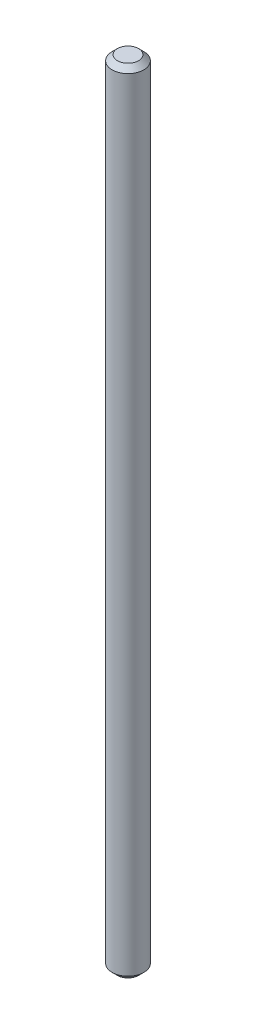
ISO-10303-21;
HEADER;
FILE_DESCRIPTION(('STEP AP214'),'2;1');
FILE_NAME('part.step','',(''),(''),'','','');
FILE_SCHEMA(('AUTOMOTIVE_DESIGN { 1 0 10303 214 1 1 1 1 }'));
ENDSEC;
DATA;
#1=APPLICATION_CONTEXT('core data for automotive mechanical design processes');
#2=APPLICATION_PROTOCOL_DEFINITION('international standard','automotive_design',2000,#1);
#3=PRODUCT_CONTEXT('',#1,'mechanical');
#4=PRODUCT('Part','Part','',(#3));
#5=PRODUCT_RELATED_PRODUCT_CATEGORY('part','',(#4));
#6=PRODUCT_DEFINITION_FORMATION('','',#4);
#7=PRODUCT_DEFINITION_CONTEXT('part definition',#1,'design');
#8=PRODUCT_DEFINITION('design','',#6,#7);
#9=PRODUCT_DEFINITION_SHAPE('','',#8);
#10=(LENGTH_UNIT() NAMED_UNIT(*) SI_UNIT(.MILLI.,.METRE.));
#11=(NAMED_UNIT(*) PLANE_ANGLE_UNIT() SI_UNIT($,.RADIAN.));
#12=(NAMED_UNIT(*) SI_UNIT($,.STERADIAN.) SOLID_ANGLE_UNIT());
#13=UNCERTAINTY_MEASURE_WITH_UNIT(LENGTH_MEASURE(1.E-05),#10,'distance_accuracy_value','');
#14=(GEOMETRIC_REPRESENTATION_CONTEXT(3) GLOBAL_UNCERTAINTY_ASSIGNED_CONTEXT((#13)) GLOBAL_UNIT_ASSIGNED_CONTEXT((#10,
#11,#12)) REPRESENTATION_CONTEXT('',''));
#15=CARTESIAN_POINT('',(0.,0.,0.));
#16=DIRECTION('',(0.,0.,1.));
#17=DIRECTION('',(1.,0.,0.));
#18=AXIS2_PLACEMENT_3D('',#15,#16,#17);
#19=CARTESIAN_POINT('',(0.,225.,0.));
#20=DIRECTION('',(0.,-1.,0.));
#21=DIRECTION('',(0.,0.,-1.));
#22=AXIS2_PLACEMENT_3D('',#19,#20,#21);
#23=CYLINDRICAL_SURFACE('',#22,9.);
#24=CARTESIAN_POINT('',(0.,222.,0.));
#25=DIRECTION('',(0.,1.,0.));
#26=DIRECTION('',(0.,0.,1.));
#27=AXIS2_PLACEMENT_3D('',#24,#25,#26);
#28=CIRCLE('',#27,9.);
#29=CARTESIAN_POINT('',(0.,222.,9.));
#30=VERTEX_POINT('',#29);
#31=EDGE_CURVE('E42',#30,#30,#28,.F.);
#32=ORIENTED_EDGE('',*,*,#31,.T.);
#33=EDGE_LOOP('',(#32));
#34=FACE_BOUND('',#33,.T.);
#35=CARTESIAN_POINT('',(0.,-222.,0.));
#36=DIRECTION('',(0.,1.,0.));
#37=DIRECTION('',(0.,0.,1.));
#38=AXIS2_PLACEMENT_3D('',#35,#36,#37);
#39=CIRCLE('',#38,9.);
#40=CARTESIAN_POINT('',(0.,-222.,9.));
#41=VERTEX_POINT('',#40);
#42=EDGE_CURVE('E46',#41,#41,#39,.T.);
#43=ORIENTED_EDGE('',*,*,#42,.T.);
#44=EDGE_LOOP('',(#43));
#45=FACE_BOUND('',#44,.T.);
#46=ADVANCED_FACE('F35',(#34,#45),#23,.T.);
#47=CARTESIAN_POINT('',(0.,225.,0.));
#48=DIRECTION('',(0.,1.,0.));
#49=DIRECTION('',(0.,0.,1.));
#50=AXIS2_PLACEMENT_3D('',#47,#48,#49);
#51=PLANE('',#50);
#52=CARTESIAN_POINT('',(0.,225.,0.));
#53=DIRECTION('',(0.,1.,0.));
#54=DIRECTION('',(0.,0.,1.));
#55=AXIS2_PLACEMENT_3D('',#52,#53,#54);
#56=CIRCLE('',#55,6.00000000000001);
#57=CARTESIAN_POINT('',(0.,225.,6.00000000000001));
#58=VERTEX_POINT('',#57);
#59=EDGE_CURVE('E50',#58,#58,#56,.T.);
#60=ORIENTED_EDGE('',*,*,#59,.T.);
#61=EDGE_LOOP('',(#60));
#62=FACE_BOUND('',#61,.T.);
#63=ADVANCED_FACE('F56',(#62),#51,.T.);
#64=CARTESIAN_POINT('',(0.,-225.,0.));
#65=DIRECTION('',(0.,1.,0.));
#66=DIRECTION('',(0.,0.,1.));
#67=AXIS2_PLACEMENT_3D('',#64,#65,#66);
#68=PLANE('',#67);
#69=CARTESIAN_POINT('',(0.,-225.,0.));
#70=DIRECTION('',(0.,1.,0.));
#71=DIRECTION('',(0.,0.,1.));
#72=AXIS2_PLACEMENT_3D('',#69,#70,#71);
#73=CIRCLE('',#72,6.00000000000001);
#74=CARTESIAN_POINT('',(0.,-225.,6.00000000000001));
#75=VERTEX_POINT('',#74);
#76=EDGE_CURVE('E10',#75,#75,#73,.F.);
#77=ORIENTED_EDGE('',*,*,#76,.T.);
#78=EDGE_LOOP('',(#77));
#79=FACE_BOUND('',#78,.T.);
#80=ADVANCED_FACE('F60',(#79),#68,.F.);
#81=CARTESIAN_POINT('',(0.,225.,0.));
#82=DIRECTION('',(0.,-1.,0.));
#83=DIRECTION('',(0.,0.,-1.));
#84=AXIS2_PLACEMENT_3D('',#81,#82,#83);
#85=CONICAL_SURFACE('',#84,6.00000000000001,0.785398163397452);
#86=ORIENTED_EDGE('',*,*,#31,.F.);
#87=EDGE_LOOP('',(#86));
#88=FACE_BOUND('',#87,.T.);
#89=ORIENTED_EDGE('',*,*,#59,.F.);
#90=EDGE_LOOP('',(#89));
#91=FACE_BOUND('',#90,.T.);
#92=ADVANCED_FACE('F58',(#88,#91),#85,.T.);
#93=CARTESIAN_POINT('',(0.,-222.,0.));
#94=DIRECTION('',(0.,1.,0.));
#95=DIRECTION('',(0.,0.,1.));
#96=AXIS2_PLACEMENT_3D('',#93,#94,#95);
#97=CONICAL_SURFACE('',#96,9.,0.785398163397456);
#98=ORIENTED_EDGE('',*,*,#76,.F.);
#99=EDGE_LOOP('',(#98));
#100=FACE_BOUND('',#99,.T.);
#101=ORIENTED_EDGE('',*,*,#42,.F.);
#102=EDGE_LOOP('',(#101));
#103=FACE_BOUND('',#102,.T.);
#104=ADVANCED_FACE('F37',(#100,#103),#97,.T.);
#105=CLOSED_SHELL('',(#46,#63,#80,#92,#104));
#106=MANIFOLD_SOLID_BREP('B2',#105);
#107=ADVANCED_BREP_SHAPE_REPRESENTATION('',(#18,#106),#14);
#108=SHAPE_DEFINITION_REPRESENTATION(#9,#107);
ENDSEC;
END-ISO-10303-21;
